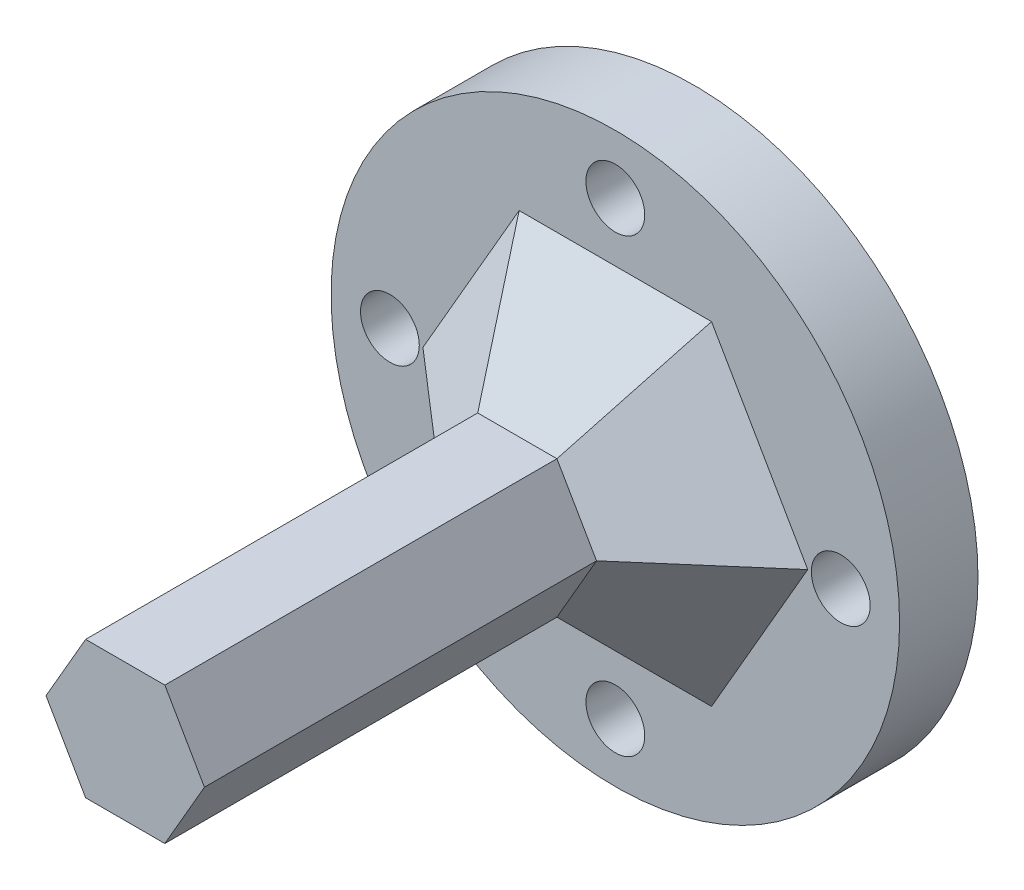
ISO-10303-21;
HEADER;
FILE_DESCRIPTION(('STEP AP214'),'2;1');
FILE_NAME('part.step','',(''),(''),'','','');
FILE_SCHEMA(('AUTOMOTIVE_DESIGN { 1 0 10303 214 1 1 1 1 }'));
ENDSEC;
DATA;
#1=APPLICATION_CONTEXT('core data for automotive mechanical design processes');
#2=APPLICATION_PROTOCOL_DEFINITION('international standard','automotive_design',2000,#1);
#3=PRODUCT_CONTEXT('',#1,'mechanical');
#4=PRODUCT('Part','Part','',(#3));
#5=PRODUCT_RELATED_PRODUCT_CATEGORY('part','',(#4));
#6=PRODUCT_DEFINITION_FORMATION('','',#4);
#7=PRODUCT_DEFINITION_CONTEXT('part definition',#1,'design');
#8=PRODUCT_DEFINITION('design','',#6,#7);
#9=PRODUCT_DEFINITION_SHAPE('','',#8);
#10=(LENGTH_UNIT() NAMED_UNIT(*) SI_UNIT(.MILLI.,.METRE.));
#11=(NAMED_UNIT(*) PLANE_ANGLE_UNIT() SI_UNIT($,.RADIAN.));
#12=(NAMED_UNIT(*) SI_UNIT($,.STERADIAN.) SOLID_ANGLE_UNIT());
#13=UNCERTAINTY_MEASURE_WITH_UNIT(LENGTH_MEASURE(1.E-05),#10,'distance_accuracy_value','');
#14=(GEOMETRIC_REPRESENTATION_CONTEXT(3) GLOBAL_UNCERTAINTY_ASSIGNED_CONTEXT((#13)) GLOBAL_UNIT_ASSIGNED_CONTEXT((#10,
#11,#12)) REPRESENTATION_CONTEXT('',''));
#15=CARTESIAN_POINT('',(0.,0.,0.));
#16=DIRECTION('',(0.,0.,1.));
#17=DIRECTION('',(1.,0.,0.));
#18=AXIS2_PLACEMENT_3D('',#15,#16,#17);
#19=CARTESIAN_POINT('',(43.4831412322115,-69.9890520639301,4.));
#20=DIRECTION('',(0.,0.,1.));
#21=DIRECTION('',(1.,0.,0.));
#22=AXIS2_PLACEMENT_3D('',#19,#20,#21);
#23=PLANE('',#22);
#24=DIRECTION('',(-0.5,0.866025403784439,0.));
#25=VECTOR('',#24,1.);
#26=CARTESIAN_POINT('',(36.1219253000442,-74.2390520639298,4.));
#27=LINE('',#26,#25);
#28=CARTESIAN_POINT('',(38.5756639440993,-78.4890520639285,4.));
#29=VERTEX_POINT('',#28);
#30=CARTESIAN_POINT('',(33.6681866559875,-69.9890520639286,4.));
#31=VERTEX_POINT('',#30);
#32=EDGE_CURVE('E168',#29,#31,#27,.T.);
#33=ORIENTED_EDGE('',*,*,#32,.T.);
#34=DIRECTION('',(0.500000000000001,0.866025403784438,0.));
#35=VECTOR('',#34,1.);
#36=CARTESIAN_POINT('',(36.1219253000429,-65.7390520639296,4.));
#37=LINE('',#36,#35);
#38=CARTESIAN_POINT('',(38.5756639440993,-61.4890520639286,4.));
#39=VERTEX_POINT('',#38);
#40=EDGE_CURVE('E178',#31,#39,#37,.T.);
#41=ORIENTED_EDGE('',*,*,#40,.T.);
#42=DIRECTION('',(1.,0.,0.));
#43=VECTOR('',#42,1.);
#44=CARTESIAN_POINT('',(43.4831412322115,-61.4890520639286,4.));
#45=LINE('',#44,#43);
#46=CARTESIAN_POINT('',(48.3906185203229,-61.4890520639286,4.));
#47=VERTEX_POINT('',#46);
#48=EDGE_CURVE('E176',#39,#47,#45,.T.);
#49=ORIENTED_EDGE('',*,*,#48,.T.);
#50=DIRECTION('',(0.500000000000001,-0.866025403784438,0.));
#51=VECTOR('',#50,1.);
#52=CARTESIAN_POINT('',(50.8443571643796,-65.7390520639299,4.));
#53=LINE('',#52,#51);
#54=CARTESIAN_POINT('',(53.2980958084347,-69.9890520639286,4.));
#55=VERTEX_POINT('',#54);
#56=EDGE_CURVE('E174',#47,#55,#53,.T.);
#57=ORIENTED_EDGE('',*,*,#56,.T.);
#58=DIRECTION('',(-0.500000000000001,-0.866025403784438,0.));
#59=VECTOR('',#58,1.);
#60=CARTESIAN_POINT('',(50.8443571643782,-74.2390520639295,4.));
#61=LINE('',#60,#59);
#62=CARTESIAN_POINT('',(48.3906185203229,-78.4890520639285,4.));
#63=VERTEX_POINT('',#62);
#64=EDGE_CURVE('E172',#55,#63,#61,.T.);
#65=ORIENTED_EDGE('',*,*,#64,.T.);
#66=DIRECTION('',(-1.,0.,0.));
#67=VECTOR('',#66,1.);
#68=CARTESIAN_POINT('',(43.4831412322115,-78.4890520639285,4.));
#69=LINE('',#68,#67);
#70=EDGE_CURVE('E170',#63,#29,#69,.T.);
#71=ORIENTED_EDGE('',*,*,#70,.T.);
#72=EDGE_LOOP('',(#33,#41,#49,#57,#65,#71));
#73=FACE_BOUND('',#72,.T.);
#74=CARTESIAN_POINT('',(31.9831412322117,-69.9890520639305,4.));
#75=DIRECTION('',(0.,0.,1.));
#76=DIRECTION('',(1.,0.,0.));
#77=AXIS2_PLACEMENT_3D('',#74,#75,#76);
#78=CIRCLE('',#77,1.49999999999953);
#79=CARTESIAN_POINT('',(33.4831412322112,-69.9890520639305,4.));
#80=VERTEX_POINT('',#79);
#81=EDGE_CURVE('E142',#80,#80,#78,.T.);
#82=ORIENTED_EDGE('',*,*,#81,.F.);
#83=EDGE_LOOP('',(#82));
#84=FACE_BOUND('',#83,.T.);
#85=CARTESIAN_POINT('',(43.4831412322117,-58.4890520639304,4.));
#86=DIRECTION('',(0.,0.,1.));
#87=DIRECTION('',(1.,0.,0.));
#88=AXIS2_PLACEMENT_3D('',#85,#86,#87);
#89=CIRCLE('',#88,1.49999999999958);
#90=CARTESIAN_POINT('',(44.9831412322113,-58.4890520639304,4.));
#91=VERTEX_POINT('',#90);
#92=EDGE_CURVE('E154',#91,#91,#89,.T.);
#93=ORIENTED_EDGE('',*,*,#92,.F.);
#94=EDGE_LOOP('',(#93));
#95=FACE_BOUND('',#94,.T.);
#96=CARTESIAN_POINT('',(43.4831412322115,-69.9890520639301,4.));
#97=DIRECTION('',(0.,0.,1.));
#98=DIRECTION('',(1.,0.,0.));
#99=AXIS2_PLACEMENT_3D('',#96,#97,#98);
#100=CIRCLE('',#99,14.4999999999996);
#101=CARTESIAN_POINT('',(57.9831412322111,-69.9890520639301,4.));
#102=VERTEX_POINT('',#101);
#103=EDGE_CURVE('E160',#102,#102,#100,.T.);
#104=ORIENTED_EDGE('',*,*,#103,.T.);
#105=EDGE_LOOP('',(#104));
#106=FACE_BOUND('',#105,.T.);
#107=CARTESIAN_POINT('',(54.9831412322117,-69.9890520639304,4.));
#108=DIRECTION('',(0.,0.,1.));
#109=DIRECTION('',(1.,0.,0.));
#110=AXIS2_PLACEMENT_3D('',#107,#108,#109);
#111=CIRCLE('',#110,1.49999999999944);
#112=CARTESIAN_POINT('',(56.4831412322111,-69.9890520639304,4.));
#113=VERTEX_POINT('',#112);
#114=EDGE_CURVE('E148',#113,#113,#111,.T.);
#115=ORIENTED_EDGE('',*,*,#114,.F.);
#116=EDGE_LOOP('',(#115));
#117=FACE_BOUND('',#116,.T.);
#118=CARTESIAN_POINT('',(43.4831412322116,-81.4890520639304,4.));
#119=DIRECTION('',(0.,0.,1.));
#120=DIRECTION('',(1.,0.,0.));
#121=AXIS2_PLACEMENT_3D('',#118,#119,#120);
#122=CIRCLE('',#121,1.49999999999938);
#123=CARTESIAN_POINT('',(44.983141232211,-81.4890520639304,4.));
#124=VERTEX_POINT('',#123);
#125=EDGE_CURVE('E133',#124,#124,#122,.T.);
#126=ORIENTED_EDGE('',*,*,#125,.F.);
#127=EDGE_LOOP('',(#126));
#128=FACE_BOUND('',#127,.T.);
#129=ADVANCED_FACE('F35',(#73,#84,#95,#106,#117,#128),#23,.T.);
#130=CARTESIAN_POINT('',(43.4831412322115,-69.9890520639301,0.));
#131=DIRECTION('',(0.,0.,1.));
#132=DIRECTION('',(1.,0.,0.));
#133=AXIS2_PLACEMENT_3D('',#130,#131,#132);
#134=PLANE('',#133);
#135=CARTESIAN_POINT('',(43.4831412322115,-69.9890520639301,0.));
#136=DIRECTION('',(0.,0.,1.));
#137=DIRECTION('',(1.,0.,0.));
#138=AXIS2_PLACEMENT_3D('',#135,#136,#137);
#139=CIRCLE('',#138,14.4999999999996);
#140=CARTESIAN_POINT('',(57.9831412322111,-69.9890520639301,0.));
#141=VERTEX_POINT('',#140);
#142=EDGE_CURVE('E157',#141,#141,#139,.T.);
#143=ORIENTED_EDGE('',*,*,#142,.F.);
#144=EDGE_LOOP('',(#143));
#145=FACE_BOUND('',#144,.T.);
#146=CARTESIAN_POINT('',(43.4831412322117,-58.4890520639304,0.));
#147=DIRECTION('',(0.,0.,1.));
#148=DIRECTION('',(1.,0.,0.));
#149=AXIS2_PLACEMENT_3D('',#146,#147,#148);
#150=CIRCLE('',#149,1.49999999999958);
#151=CARTESIAN_POINT('',(44.9831412322113,-58.4890520639304,0.));
#152=VERTEX_POINT('',#151);
#153=EDGE_CURVE('E151',#152,#152,#150,.T.);
#154=ORIENTED_EDGE('',*,*,#153,.T.);
#155=EDGE_LOOP('',(#154));
#156=FACE_BOUND('',#155,.T.);
#157=CARTESIAN_POINT('',(54.9831412322117,-69.9890520639304,0.));
#158=DIRECTION('',(0.,0.,1.));
#159=DIRECTION('',(1.,0.,0.));
#160=AXIS2_PLACEMENT_3D('',#157,#158,#159);
#161=CIRCLE('',#160,1.49999999999944);
#162=CARTESIAN_POINT('',(56.4831412322111,-69.9890520639304,0.));
#163=VERTEX_POINT('',#162);
#164=EDGE_CURVE('E145',#163,#163,#161,.T.);
#165=ORIENTED_EDGE('',*,*,#164,.T.);
#166=EDGE_LOOP('',(#165));
#167=FACE_BOUND('',#166,.T.);
#168=CARTESIAN_POINT('',(31.9831412322117,-69.9890520639305,0.));
#169=DIRECTION('',(0.,0.,1.));
#170=DIRECTION('',(1.,0.,0.));
#171=AXIS2_PLACEMENT_3D('',#168,#169,#170);
#172=CIRCLE('',#171,1.49999999999953);
#173=CARTESIAN_POINT('',(33.4831412322112,-69.9890520639305,0.));
#174=VERTEX_POINT('',#173);
#175=EDGE_CURVE('E140',#174,#174,#172,.T.);
#176=ORIENTED_EDGE('',*,*,#175,.T.);
#177=EDGE_LOOP('',(#176));
#178=FACE_BOUND('',#177,.T.);
#179=CARTESIAN_POINT('',(43.4831412322116,-81.4890520639304,0.));
#180=DIRECTION('',(0.,0.,1.));
#181=DIRECTION('',(1.,0.,0.));
#182=AXIS2_PLACEMENT_3D('',#179,#180,#181);
#183=CIRCLE('',#182,1.49999999999938);
#184=CARTESIAN_POINT('',(44.983141232211,-81.4890520639304,0.));
#185=VERTEX_POINT('',#184);
#186=EDGE_CURVE('E130',#185,#185,#183,.T.);
#187=ORIENTED_EDGE('',*,*,#186,.T.);
#188=EDGE_LOOP('',(#187));
#189=FACE_BOUND('',#188,.T.);
#190=ADVANCED_FACE('F251',(#145,#156,#167,#178,#189),#134,.F.);
#191=CARTESIAN_POINT('',(43.4831412322115,-69.9890520639301,4.));
#192=DIRECTION('',(0.,0.,-1.));
#193=DIRECTION('',(-1.,0.,0.));
#194=AXIS2_PLACEMENT_3D('',#191,#192,#193);
#195=CYLINDRICAL_SURFACE('',#194,14.4999999999996);
#196=ORIENTED_EDGE('',*,*,#103,.F.);
#197=EDGE_LOOP('',(#196));
#198=FACE_BOUND('',#197,.T.);
#199=ORIENTED_EDGE('',*,*,#142,.T.);
#200=EDGE_LOOP('',(#199));
#201=FACE_BOUND('',#200,.T.);
#202=ADVANCED_FACE('F256',(#198,#201),#195,.T.);
#203=CARTESIAN_POINT('',(43.4831412322117,-58.4890520639304,4.));
#204=DIRECTION('',(0.,0.,-1.));
#205=DIRECTION('',(-1.,0.,0.));
#206=AXIS2_PLACEMENT_3D('',#203,#204,#205);
#207=CYLINDRICAL_SURFACE('',#206,1.49999999999958);
#208=ORIENTED_EDGE('',*,*,#92,.T.);
#209=EDGE_LOOP('',(#208));
#210=FACE_BOUND('',#209,.T.);
#211=ORIENTED_EDGE('',*,*,#153,.F.);
#212=EDGE_LOOP('',(#211));
#213=FACE_BOUND('',#212,.T.);
#214=ADVANCED_FACE('F260',(#210,#213),#207,.F.);
#215=CARTESIAN_POINT('',(54.9831412322117,-69.9890520639304,4.));
#216=DIRECTION('',(0.,0.,-1.));
#217=DIRECTION('',(-1.,0.,0.));
#218=AXIS2_PLACEMENT_3D('',#215,#216,#217);
#219=CYLINDRICAL_SURFACE('',#218,1.49999999999944);
#220=ORIENTED_EDGE('',*,*,#114,.T.);
#221=EDGE_LOOP('',(#220));
#222=FACE_BOUND('',#221,.T.);
#223=ORIENTED_EDGE('',*,*,#164,.F.);
#224=EDGE_LOOP('',(#223));
#225=FACE_BOUND('',#224,.T.);
#226=ADVANCED_FACE('F349',(#222,#225),#219,.F.);
#227=CARTESIAN_POINT('',(31.9831412322117,-69.9890520639305,4.));
#228=DIRECTION('',(0.,0.,-1.));
#229=DIRECTION('',(-1.,0.,0.));
#230=AXIS2_PLACEMENT_3D('',#227,#228,#229);
#231=CYLINDRICAL_SURFACE('',#230,1.49999999999953);
#232=ORIENTED_EDGE('',*,*,#81,.T.);
#233=EDGE_LOOP('',(#232));
#234=FACE_BOUND('',#233,.T.);
#235=ORIENTED_EDGE('',*,*,#175,.F.);
#236=EDGE_LOOP('',(#235));
#237=FACE_BOUND('',#236,.T.);
#238=ADVANCED_FACE('F346',(#234,#237),#231,.F.);
#239=CARTESIAN_POINT('',(43.4831412322116,-81.4890520639304,4.));
#240=DIRECTION('',(0.,0.,-1.));
#241=DIRECTION('',(-1.,0.,0.));
#242=AXIS2_PLACEMENT_3D('',#239,#240,#241);
#243=CYLINDRICAL_SURFACE('',#242,1.49999999999938);
#244=ORIENTED_EDGE('',*,*,#125,.T.);
#245=EDGE_LOOP('',(#244));
#246=FACE_BOUND('',#245,.T.);
#247=ORIENTED_EDGE('',*,*,#186,.F.);
#248=EDGE_LOOP('',(#247));
#249=FACE_BOUND('',#248,.T.);
#250=ADVANCED_FACE('F294',(#246,#249),#243,.F.);
#251=CARTESIAN_POINT('',(45.5038671743748,-73.4890520639286,29.));
#252=DIRECTION('',(-0.866025403784438,0.500000000000001,0.));
#253=DIRECTION('',(-0.500000000000001,-0.866025403784438,0.));
#254=AXIS2_PLACEMENT_3D('',#251,#252,#253);
#255=PLANE('',#254);
#256=DIRECTION('',(0.,0.,-1.));
#257=VECTOR('',#256,1.);
#258=CARTESIAN_POINT('',(45.5038671743748,-73.4890520639286,29.));
#259=LINE('',#258,#257);
#260=CARTESIAN_POINT('',(45.5038671743748,-73.4890520639286,29.));
#261=VERTEX_POINT('',#260);
#262=CARTESIAN_POINT('',(45.5038671743748,-73.4890520639286,9.00000000000002));
#263=VERTEX_POINT('',#262);
#264=EDGE_CURVE('E233',#261,#263,#259,.T.);
#265=ORIENTED_EDGE('',*,*,#264,.T.);
#266=DIRECTION('',(0.500000000000001,0.866025403784438,0.));
#267=VECTOR('',#266,1.);
#268=CARTESIAN_POINT('',(45.5038671743748,-73.4890520639286,9.00000000000002));
#269=LINE('',#268,#267);
#270=CARTESIAN_POINT('',(47.5245931165385,-69.9890520639286,9.00000000000002));
#271=VERTEX_POINT('',#270);
#272=EDGE_CURVE('E129',#263,#271,#269,.T.);
#273=ORIENTED_EDGE('',*,*,#272,.T.);
#274=DIRECTION('',(0.,0.,-1.));
#275=VECTOR('',#274,1.);
#276=CARTESIAN_POINT('',(47.5245931165385,-69.9890520639286,29.));
#277=LINE('',#276,#275);
#278=CARTESIAN_POINT('',(47.5245931165385,-69.9890520639286,29.));
#279=VERTEX_POINT('',#278);
#280=EDGE_CURVE('E112',#279,#271,#277,.T.);
#281=ORIENTED_EDGE('',*,*,#280,.F.);
#282=DIRECTION('',(0.500000000000001,0.866025403784438,0.));
#283=VECTOR('',#282,1.);
#284=CARTESIAN_POINT('',(45.5038671743748,-73.4890520639286,29.));
#285=LINE('',#284,#283);
#286=EDGE_CURVE('E119',#261,#279,#285,.T.);
#287=ORIENTED_EDGE('',*,*,#286,.F.);
#288=EDGE_LOOP('',(#265,#273,#281,#287));
#289=FACE_BOUND('',#288,.T.);
#290=ADVANCED_FACE('F127',(#289),#255,.F.);
#291=CARTESIAN_POINT('',(47.5245931165385,-69.9890520639286,29.));
#292=DIRECTION('',(-0.866025403784438,-0.500000000000001,0.));
#293=DIRECTION('',(0.500000000000001,-0.866025403784438,0.));
#294=AXIS2_PLACEMENT_3D('',#291,#292,#293);
#295=PLANE('',#294);
#296=ORIENTED_EDGE('',*,*,#280,.T.);
#297=DIRECTION('',(-0.500000000000001,0.866025403784438,0.));
#298=VECTOR('',#297,1.);
#299=CARTESIAN_POINT('',(47.5245931165385,-69.9890520639286,9.00000000000002));
#300=LINE('',#299,#298);
#301=CARTESIAN_POINT('',(45.5038671743748,-66.4890520639286,9.00000000000002));
#302=VERTEX_POINT('',#301);
#303=EDGE_CURVE('E183',#271,#302,#300,.T.);
#304=ORIENTED_EDGE('',*,*,#303,.T.);
#305=DIRECTION('',(0.,0.,-1.));
#306=VECTOR('',#305,1.);
#307=CARTESIAN_POINT('',(45.5038671743748,-66.4890520639286,29.));
#308=LINE('',#307,#306);
#309=CARTESIAN_POINT('',(45.5038671743748,-66.4890520639286,29.));
#310=VERTEX_POINT('',#309);
#311=EDGE_CURVE('E115',#310,#302,#308,.T.);
#312=ORIENTED_EDGE('',*,*,#311,.F.);
#313=DIRECTION('',(-0.500000000000001,0.866025403784438,0.));
#314=VECTOR('',#313,1.);
#315=CARTESIAN_POINT('',(47.5245931165385,-69.9890520639286,29.));
#316=LINE('',#315,#314);
#317=EDGE_CURVE('E108',#279,#310,#316,.T.);
#318=ORIENTED_EDGE('',*,*,#317,.F.);
#319=EDGE_LOOP('',(#296,#304,#312,#318));
#320=FACE_BOUND('',#319,.T.);
#321=ADVANCED_FACE('F110',(#320),#295,.F.);
#322=CARTESIAN_POINT('',(45.5038671743748,-66.4890520639286,29.));
#323=DIRECTION('',(0.,-1.,0.));
#324=DIRECTION('',(0.,0.,-1.));
#325=AXIS2_PLACEMENT_3D('',#322,#323,#324);
#326=PLANE('',#325);
#327=ORIENTED_EDGE('',*,*,#311,.T.);
#328=DIRECTION('',(-1.,0.,0.));
#329=VECTOR('',#328,1.);
#330=CARTESIAN_POINT('',(45.5038671743748,-66.4890520639286,9.00000000000002));
#331=LINE('',#330,#329);
#332=CARTESIAN_POINT('',(41.4624152900474,-66.4890520639286,9.00000000000002));
#333=VERTEX_POINT('',#332);
#334=EDGE_CURVE('E181',#302,#333,#331,.T.);
#335=ORIENTED_EDGE('',*,*,#334,.T.);
#336=DIRECTION('',(0.,0.,-1.));
#337=VECTOR('',#336,1.);
#338=CARTESIAN_POINT('',(41.4624152900474,-66.4890520639286,29.));
#339=LINE('',#338,#337);
#340=CARTESIAN_POINT('',(41.4624152900474,-66.4890520639286,29.));
#341=VERTEX_POINT('',#340);
#342=EDGE_CURVE('E135',#341,#333,#339,.T.);
#343=ORIENTED_EDGE('',*,*,#342,.F.);
#344=DIRECTION('',(-1.,0.,0.));
#345=VECTOR('',#344,1.);
#346=CARTESIAN_POINT('',(45.5038671743748,-66.4890520639286,29.));
#347=LINE('',#346,#345);
#348=EDGE_CURVE('E118',#310,#341,#347,.T.);
#349=ORIENTED_EDGE('',*,*,#348,.F.);
#350=EDGE_LOOP('',(#327,#335,#343,#349));
#351=FACE_BOUND('',#350,.T.);
#352=ADVANCED_FACE('F222',(#351),#326,.F.);
#353=CARTESIAN_POINT('',(41.4624152900474,-66.4890520639286,29.));
#354=DIRECTION('',(0.866025403784438,-0.500000000000001,0.));
#355=DIRECTION('',(0.500000000000001,0.866025403784438,0.));
#356=AXIS2_PLACEMENT_3D('',#353,#354,#355);
#357=PLANE('',#356);
#358=ORIENTED_EDGE('',*,*,#342,.T.);
#359=DIRECTION('',(-0.500000000000001,-0.866025403784438,0.));
#360=VECTOR('',#359,1.);
#361=CARTESIAN_POINT('',(41.4624152900474,-66.4890520639286,9.00000000000002));
#362=LINE('',#361,#360);
#363=CARTESIAN_POINT('',(39.4416893478838,-69.9890520639286,9.00000000000002));
#364=VERTEX_POINT('',#363);
#365=EDGE_CURVE('E163',#333,#364,#362,.T.);
#366=ORIENTED_EDGE('',*,*,#365,.T.);
#367=DIRECTION('',(0.,0.,-1.));
#368=VECTOR('',#367,1.);
#369=CARTESIAN_POINT('',(39.4416893478838,-69.9890520639286,29.));
#370=LINE('',#369,#368);
#371=CARTESIAN_POINT('',(39.4416893478838,-69.9890520639286,29.));
#372=VERTEX_POINT('',#371);
#373=EDGE_CURVE('E228',#372,#364,#370,.T.);
#374=ORIENTED_EDGE('',*,*,#373,.F.);
#375=DIRECTION('',(-0.500000000000001,-0.866025403784438,0.));
#376=VECTOR('',#375,1.);
#377=CARTESIAN_POINT('',(41.4624152900474,-66.4890520639286,29.));
#378=LINE('',#377,#376);
#379=EDGE_CURVE('E227',#341,#372,#378,.T.);
#380=ORIENTED_EDGE('',*,*,#379,.F.);
#381=EDGE_LOOP('',(#358,#366,#374,#380));
#382=FACE_BOUND('',#381,.T.);
#383=ADVANCED_FACE('F225',(#382),#357,.F.);
#384=CARTESIAN_POINT('',(39.4416893478838,-69.9890520639286,29.));
#385=DIRECTION('',(0.866025403784439,0.5,0.));
#386=DIRECTION('',(-0.5,0.866025403784439,0.));
#387=AXIS2_PLACEMENT_3D('',#384,#385,#386);
#388=PLANE('',#387);
#389=ORIENTED_EDGE('',*,*,#373,.T.);
#390=DIRECTION('',(0.5,-0.866025403784439,0.));
#391=VECTOR('',#390,1.);
#392=CARTESIAN_POINT('',(39.4416893478838,-69.9890520639286,9.00000000000002));
#393=LINE('',#392,#391);
#394=CARTESIAN_POINT('',(41.4624152900474,-73.4890520639286,9.00000000000002));
#395=VERTEX_POINT('',#394);
#396=EDGE_CURVE('E11',#364,#395,#393,.T.);
#397=ORIENTED_EDGE('',*,*,#396,.T.);
#398=DIRECTION('',(0.,0.,-1.));
#399=VECTOR('',#398,1.);
#400=CARTESIAN_POINT('',(41.4624152900474,-73.4890520639286,29.));
#401=LINE('',#400,#399);
#402=CARTESIAN_POINT('',(41.4624152900474,-73.4890520639286,29.));
#403=VERTEX_POINT('',#402);
#404=EDGE_CURVE('E229',#403,#395,#401,.T.);
#405=ORIENTED_EDGE('',*,*,#404,.F.);
#406=DIRECTION('',(0.5,-0.866025403784439,0.));
#407=VECTOR('',#406,1.);
#408=CARTESIAN_POINT('',(39.4416893478838,-69.9890520639286,29.));
#409=LINE('',#408,#407);
#410=EDGE_CURVE('E236',#372,#403,#409,.T.);
#411=ORIENTED_EDGE('',*,*,#410,.F.);
#412=EDGE_LOOP('',(#389,#397,#405,#411));
#413=FACE_BOUND('',#412,.T.);
#414=ADVANCED_FACE('F240',(#413),#388,.F.);
#415=CARTESIAN_POINT('',(41.4624152900474,-73.4890520639286,29.));
#416=DIRECTION('',(0.,1.,0.));
#417=DIRECTION('',(0.,0.,1.));
#418=AXIS2_PLACEMENT_3D('',#415,#416,#417);
#419=PLANE('',#418);
#420=ORIENTED_EDGE('',*,*,#404,.T.);
#421=DIRECTION('',(1.,0.,0.));
#422=VECTOR('',#421,1.);
#423=CARTESIAN_POINT('',(41.4624152900474,-73.4890520639286,9.00000000000002));
#424=LINE('',#423,#422);
#425=EDGE_CURVE('E44',#395,#263,#424,.T.);
#426=ORIENTED_EDGE('',*,*,#425,.T.);
#427=ORIENTED_EDGE('',*,*,#264,.F.);
#428=DIRECTION('',(1.,0.,0.));
#429=VECTOR('',#428,1.);
#430=CARTESIAN_POINT('',(41.4624152900474,-73.4890520639286,29.));
#431=LINE('',#430,#429);
#432=EDGE_CURVE('E124',#403,#261,#431,.T.);
#433=ORIENTED_EDGE('',*,*,#432,.F.);
#434=EDGE_LOOP('',(#420,#426,#427,#433));
#435=FACE_BOUND('',#434,.T.);
#436=ADVANCED_FACE('F241',(#435),#419,.F.);
#437=CARTESIAN_POINT('',(0.,0.,29.));
#438=DIRECTION('',(0.,0.,1.));
#439=DIRECTION('',(1.,0.,0.));
#440=AXIS2_PLACEMENT_3D('',#437,#438,#439);
#441=PLANE('',#440);
#442=ORIENTED_EDGE('',*,*,#286,.T.);
#443=ORIENTED_EDGE('',*,*,#317,.T.);
#444=ORIENTED_EDGE('',*,*,#348,.T.);
#445=ORIENTED_EDGE('',*,*,#379,.T.);
#446=ORIENTED_EDGE('',*,*,#410,.T.);
#447=ORIENTED_EDGE('',*,*,#432,.T.);
#448=EDGE_LOOP('',(#442,#443,#444,#445,#446,#447));
#449=FACE_BOUND('',#448,.T.);
#450=ADVANCED_FACE('F122',(#449),#441,.T.);
#451=CARTESIAN_POINT('',(45.5038671743748,-73.4890520639286,9.00000000000002));
#452=DIRECTION('',(-0.612372435695798,0.353553390593276,-0.707106781186543));
#453=DIRECTION('',(0.500000000000001,0.866025403784438,0.));
#454=AXIS2_PLACEMENT_3D('',#451,#452,#453);
#455=PLANE('',#454);
#456=DIRECTION('',(-0.377964473009225,0.654653670707974,0.654653670707982));
#457=VECTOR('',#456,1.);
#458=CARTESIAN_POINT('',(44.9265169051852,-72.4890520639286,10.));
#459=LINE('',#458,#457);
#460=EDGE_CURVE('E196',#63,#263,#459,.T.);
#461=ORIENTED_EDGE('',*,*,#460,.F.);
#462=ORIENTED_EDGE('',*,*,#64,.F.);
#463=DIRECTION('',(-0.755928946018451,0.,0.654653670707981));
#464=VECTOR('',#463,1.);
#465=CARTESIAN_POINT('',(46.3698925781593,-69.9890520639286,10.));
#466=LINE('',#465,#464);
#467=EDGE_CURVE('E39',#271,#55,#466,.F.);
#468=ORIENTED_EDGE('',*,*,#467,.F.);
#469=ORIENTED_EDGE('',*,*,#272,.F.);
#470=EDGE_LOOP('',(#461,#462,#468,#469));
#471=FACE_BOUND('',#470,.T.);
#472=ADVANCED_FACE('F37',(#471),#455,.F.);
#473=CARTESIAN_POINT('',(47.5245931165385,-69.9890520639286,9.00000000000002));
#474=DIRECTION('',(-0.612372435695798,-0.353553390593276,-0.707106781186543));
#475=DIRECTION('',(-0.500000000000001,0.866025403784438,0.));
#476=AXIS2_PLACEMENT_3D('',#473,#474,#475);
#477=PLANE('',#476);
#478=ORIENTED_EDGE('',*,*,#467,.T.);
#479=ORIENTED_EDGE('',*,*,#56,.F.);
#480=DIRECTION('',(-0.377964473009226,-0.654653670707974,0.654653670707982));
#481=VECTOR('',#480,1.);
#482=CARTESIAN_POINT('',(44.9265169051852,-67.4890520639286,10.));
#483=LINE('',#482,#481);
#484=EDGE_CURVE('E194',#302,#47,#483,.F.);
#485=ORIENTED_EDGE('',*,*,#484,.F.);
#486=ORIENTED_EDGE('',*,*,#303,.F.);
#487=EDGE_LOOP('',(#478,#479,#485,#486));
#488=FACE_BOUND('',#487,.T.);
#489=ADVANCED_FACE('F205',(#488),#477,.F.);
#490=CARTESIAN_POINT('',(41.4624152900474,-73.4890520639286,9.00000000000002));
#491=DIRECTION('',(0.,0.707106781186551,-0.707106781186544));
#492=DIRECTION('',(1.,0.,0.));
#493=AXIS2_PLACEMENT_3D('',#490,#491,#492);
#494=PLANE('',#493);
#495=ORIENTED_EDGE('',*,*,#460,.T.);
#496=ORIENTED_EDGE('',*,*,#425,.F.);
#497=DIRECTION('',(0.377964473009225,0.654653670707974,0.654653670707982));
#498=VECTOR('',#497,1.);
#499=CARTESIAN_POINT('',(42.0397655592371,-72.4890520639286,10.));
#500=LINE('',#499,#498);
#501=EDGE_CURVE('E191',#29,#395,#500,.T.);
#502=ORIENTED_EDGE('',*,*,#501,.F.);
#503=ORIENTED_EDGE('',*,*,#70,.F.);
#504=EDGE_LOOP('',(#495,#496,#502,#503));
#505=FACE_BOUND('',#504,.T.);
#506=ADVANCED_FACE('F276',(#505),#494,.F.);
#507=CARTESIAN_POINT('',(45.5038671743748,-66.4890520639286,9.00000000000002));
#508=DIRECTION('',(0.,-0.707106781186552,-0.707106781186543));
#509=DIRECTION('',(-1.,0.,0.));
#510=AXIS2_PLACEMENT_3D('',#507,#508,#509);
#511=PLANE('',#510);
#512=ORIENTED_EDGE('',*,*,#484,.T.);
#513=ORIENTED_EDGE('',*,*,#48,.F.);
#514=DIRECTION('',(0.377964473009226,-0.654653670707973,0.654653670707982));
#515=VECTOR('',#514,1.);
#516=CARTESIAN_POINT('',(42.0397655592371,-67.4890520639286,10.));
#517=LINE('',#516,#515);
#518=EDGE_CURVE('E189',#333,#39,#517,.F.);
#519=ORIENTED_EDGE('',*,*,#518,.F.);
#520=ORIENTED_EDGE('',*,*,#334,.F.);
#521=EDGE_LOOP('',(#512,#513,#519,#520));
#522=FACE_BOUND('',#521,.T.);
#523=ADVANCED_FACE('F216',(#522),#511,.F.);
#524=CARTESIAN_POINT('',(39.4416893478838,-69.9890520639286,9.00000000000002));
#525=DIRECTION('',(0.612372435695798,0.353553390593276,-0.707106781186543));
#526=DIRECTION('',(0.5,-0.866025403784439,0.));
#527=AXIS2_PLACEMENT_3D('',#524,#525,#526);
#528=PLANE('',#527);
#529=ORIENTED_EDGE('',*,*,#501,.T.);
#530=ORIENTED_EDGE('',*,*,#396,.F.);
#531=DIRECTION('',(-0.755928946018451,0.,-0.654653670707982));
#532=VECTOR('',#531,1.);
#533=CARTESIAN_POINT('',(39.4416893478838,-69.9890520639286,9.00000000000002));
#534=LINE('',#533,#532);
#535=EDGE_CURVE('E187',#31,#364,#534,.F.);
#536=ORIENTED_EDGE('',*,*,#535,.F.);
#537=ORIENTED_EDGE('',*,*,#32,.F.);
#538=EDGE_LOOP('',(#529,#530,#536,#537));
#539=FACE_BOUND('',#538,.T.);
#540=ADVANCED_FACE('F269',(#539),#528,.F.);
#541=CARTESIAN_POINT('',(41.4624152900474,-66.4890520639286,9.00000000000002));
#542=DIRECTION('',(0.612372435695798,-0.353553390593276,-0.707106781186544));
#543=DIRECTION('',(-0.500000000000001,-0.866025403784438,0.));
#544=AXIS2_PLACEMENT_3D('',#541,#542,#543);
#545=PLANE('',#544);
#546=ORIENTED_EDGE('',*,*,#518,.T.);
#547=ORIENTED_EDGE('',*,*,#40,.F.);
#548=ORIENTED_EDGE('',*,*,#535,.T.);
#549=ORIENTED_EDGE('',*,*,#365,.F.);
#550=EDGE_LOOP('',(#546,#547,#548,#549));
#551=FACE_BOUND('',#550,.T.);
#552=ADVANCED_FACE('F266',(#551),#545,.F.);
#553=CLOSED_SHELL('',(#129,#190,#202,#214,#226,#238,#250,#290,#321,#352,#383,#414,#436,#450,
#472,#489,#506,#523,#540,#552));
#554=MANIFOLD_SOLID_BREP('B2',#553);
#555=ADVANCED_BREP_SHAPE_REPRESENTATION('',(#18,#554),#14);
#556=SHAPE_DEFINITION_REPRESENTATION(#9,#555);
ENDSEC;
END-ISO-10303-21;
